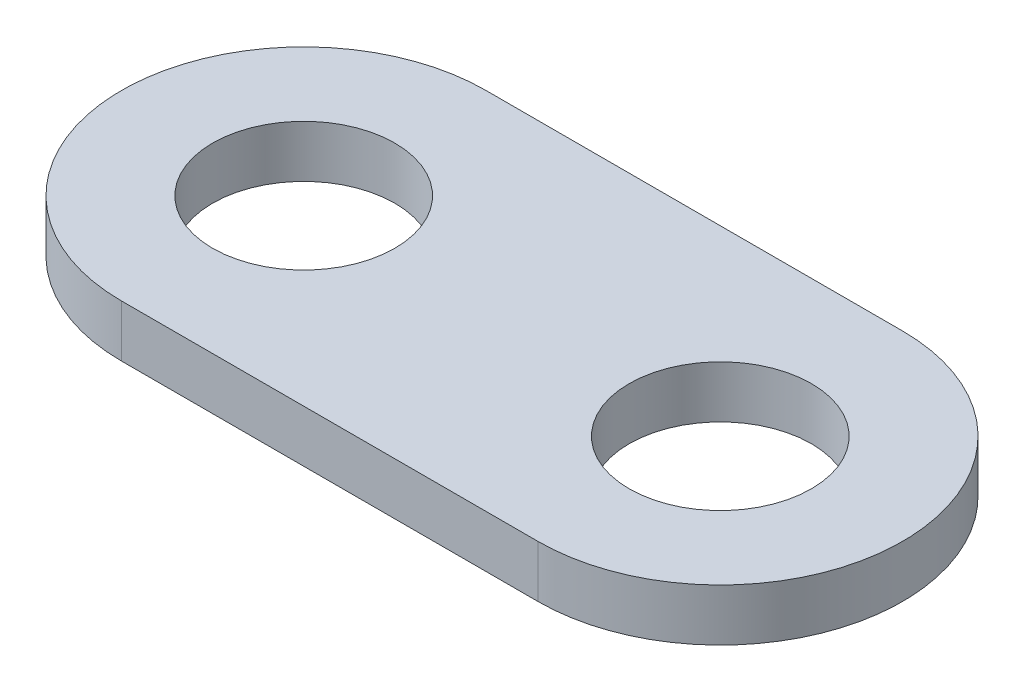
ISO-10303-21;
HEADER;
FILE_DESCRIPTION(('STEP AP214'),'2;1');
FILE_NAME('part.step','',(''),(''),'','','');
FILE_SCHEMA(('AUTOMOTIVE_DESIGN { 1 0 10303 214 1 1 1 1 }'));
ENDSEC;
DATA;
#1=APPLICATION_CONTEXT('core data for automotive mechanical design processes');
#2=APPLICATION_PROTOCOL_DEFINITION('international standard','automotive_design',2000,#1);
#3=PRODUCT_CONTEXT('',#1,'mechanical');
#4=PRODUCT('Part','Part','',(#3));
#5=PRODUCT_RELATED_PRODUCT_CATEGORY('part','',(#4));
#6=PRODUCT_DEFINITION_FORMATION('','',#4);
#7=PRODUCT_DEFINITION_CONTEXT('part definition',#1,'design');
#8=PRODUCT_DEFINITION('design','',#6,#7);
#9=PRODUCT_DEFINITION_SHAPE('','',#8);
#10=(LENGTH_UNIT() NAMED_UNIT(*) SI_UNIT(.MILLI.,.METRE.));
#11=(NAMED_UNIT(*) PLANE_ANGLE_UNIT() SI_UNIT($,.RADIAN.));
#12=(NAMED_UNIT(*) SI_UNIT($,.STERADIAN.) SOLID_ANGLE_UNIT());
#13=UNCERTAINTY_MEASURE_WITH_UNIT(LENGTH_MEASURE(1.E-05),#10,'distance_accuracy_value','');
#14=(GEOMETRIC_REPRESENTATION_CONTEXT(3) GLOBAL_UNCERTAINTY_ASSIGNED_CONTEXT((#13)) GLOBAL_UNIT_ASSIGNED_CONTEXT((#10,
#11,#12)) REPRESENTATION_CONTEXT('',''));
#15=CARTESIAN_POINT('',(0.,0.,0.));
#16=DIRECTION('',(0.,0.,1.));
#17=DIRECTION('',(1.,0.,0.));
#18=AXIS2_PLACEMENT_3D('',#15,#16,#17);
#19=CARTESIAN_POINT('',(-93.1927710843373,10.,4.25551654230957));
#20=DIRECTION('',(0.,1.,0.));
#21=DIRECTION('',(0.,0.,1.));
#22=AXIS2_PLACEMENT_3D('',#19,#20,#21);
#23=PLANE('',#22);
#24=CARTESIAN_POINT('',(-93.1927710843373,10.,4.25551654230957));
#25=DIRECTION('',(0.,1.,0.));
#26=DIRECTION('',(0.,0.,1.));
#27=AXIS2_PLACEMENT_3D('',#24,#25,#26);
#28=CIRCLE('',#27,17.5);
#29=CARTESIAN_POINT('',(-93.1927710843373,10.,21.7555165423096));
#30=VERTEX_POINT('',#29);
#31=EDGE_CURVE('E114',#30,#30,#28,.T.);
#32=ORIENTED_EDGE('',*,*,#31,.F.);
#33=EDGE_LOOP('',(#32));
#34=FACE_BOUND('',#33,.T.);
#35=CARTESIAN_POINT('',(-93.1927710843373,10.,4.25551654230957));
#36=DIRECTION('',(0.,1.,0.));
#37=DIRECTION('',(0.,0.,1.));
#38=AXIS2_PLACEMENT_3D('',#35,#36,#37);
#39=CIRCLE('',#38,35.);
#40=CARTESIAN_POINT('',(-93.1927710843373,10.,-30.7444834576904));
#41=VERTEX_POINT('',#40);
#42=CARTESIAN_POINT('',(-93.1927710843373,10.,39.2555165423096));
#43=VERTEX_POINT('',#42);
#44=EDGE_CURVE('E99',#41,#43,#39,.T.);
#45=ORIENTED_EDGE('',*,*,#44,.T.);
#46=DIRECTION('',(1.,0.,0.));
#47=VECTOR('',#46,1.);
#48=CARTESIAN_POINT('',(-93.1927710843373,10.,39.2555165423096));
#49=LINE('',#48,#47);
#50=CARTESIAN_POINT('',(-13.1927710843373,10.,39.2555165423096));
#51=VERTEX_POINT('',#50);
#52=EDGE_CURVE('E94',#43,#51,#49,.T.);
#53=ORIENTED_EDGE('',*,*,#52,.T.);
#54=CARTESIAN_POINT('',(-13.1927710843373,10.,4.25551654230957));
#55=DIRECTION('',(0.,1.,0.));
#56=DIRECTION('',(0.,0.,-1.));
#57=AXIS2_PLACEMENT_3D('',#54,#55,#56);
#58=CIRCLE('',#57,35.);
#59=CARTESIAN_POINT('',(-13.1927710843373,10.,-30.7444834576904));
#60=VERTEX_POINT('',#59);
#61=EDGE_CURVE('E97',#51,#60,#58,.T.);
#62=ORIENTED_EDGE('',*,*,#61,.T.);
#63=DIRECTION('',(-1.,0.,0.));
#64=VECTOR('',#63,1.);
#65=CARTESIAN_POINT('',(-93.1927710843373,10.,-30.7444834576904));
#66=LINE('',#65,#64);
#67=EDGE_CURVE('E64',#60,#41,#66,.T.);
#68=ORIENTED_EDGE('',*,*,#67,.T.);
#69=EDGE_LOOP('',(#45,#53,#62,#68));
#70=FACE_BOUND('',#69,.T.);
#71=CARTESIAN_POINT('',(-13.1927710843373,10.,4.25551654230957));
#72=DIRECTION('',(0.,1.,0.));
#73=DIRECTION('',(0.,0.,1.));
#74=AXIS2_PLACEMENT_3D('',#71,#72,#73);
#75=CIRCLE('',#74,17.5);
#76=CARTESIAN_POINT('',(-13.1927710843373,10.,21.7555165423096));
#77=VERTEX_POINT('',#76);
#78=EDGE_CURVE('E129',#77,#77,#75,.T.);
#79=ORIENTED_EDGE('',*,*,#78,.F.);
#80=EDGE_LOOP('',(#79));
#81=FACE_BOUND('',#80,.T.);
#82=ADVANCED_FACE('F47',(#34,#70,#81),#23,.T.);
#83=CARTESIAN_POINT('',(-93.1927710843373,0.,4.25551654230957));
#84=DIRECTION('',(0.,1.,0.));
#85=DIRECTION('',(0.,0.,1.));
#86=AXIS2_PLACEMENT_3D('',#83,#84,#85);
#87=PLANE('',#86);
#88=CARTESIAN_POINT('',(-93.1927710843373,0.,4.25551654230957));
#89=DIRECTION('',(0.,1.,0.));
#90=DIRECTION('',(0.,0.,1.));
#91=AXIS2_PLACEMENT_3D('',#88,#89,#90);
#92=CIRCLE('',#91,35.);
#93=CARTESIAN_POINT('',(-93.1927710843373,0.,-30.7444834576904));
#94=VERTEX_POINT('',#93);
#95=CARTESIAN_POINT('',(-93.1927710843373,0.,39.2555165423096));
#96=VERTEX_POINT('',#95);
#97=EDGE_CURVE('E111',#94,#96,#92,.T.);
#98=ORIENTED_EDGE('',*,*,#97,.F.);
#99=DIRECTION('',(-1.,0.,0.));
#100=VECTOR('',#99,1.);
#101=CARTESIAN_POINT('',(-93.1927710843373,0.,-30.7444834576904));
#102=LINE('',#101,#100);
#103=CARTESIAN_POINT('',(-13.1927710843373,0.,-30.7444834576904));
#104=VERTEX_POINT('',#103);
#105=EDGE_CURVE('E87',#104,#94,#102,.T.);
#106=ORIENTED_EDGE('',*,*,#105,.F.);
#107=CARTESIAN_POINT('',(-13.1927710843373,0.,4.25551654230957));
#108=DIRECTION('',(0.,1.,0.));
#109=DIRECTION('',(0.,0.,-1.));
#110=AXIS2_PLACEMENT_3D('',#107,#108,#109);
#111=CIRCLE('',#110,35.);
#112=CARTESIAN_POINT('',(-13.1927710843373,0.,39.2555165423096));
#113=VERTEX_POINT('',#112);
#114=EDGE_CURVE('E81',#113,#104,#111,.T.);
#115=ORIENTED_EDGE('',*,*,#114,.F.);
#116=DIRECTION('',(1.,0.,0.));
#117=VECTOR('',#116,1.);
#118=CARTESIAN_POINT('',(-93.1927710843373,0.,39.2555165423096));
#119=LINE('',#118,#117);
#120=EDGE_CURVE('E103',#96,#113,#119,.T.);
#121=ORIENTED_EDGE('',*,*,#120,.F.);
#122=EDGE_LOOP('',(#98,#106,#115,#121));
#123=FACE_BOUND('',#122,.T.);
#124=CARTESIAN_POINT('',(-93.1927710843373,0.,4.25551654230957));
#125=DIRECTION('',(0.,1.,0.));
#126=DIRECTION('',(0.,0.,1.));
#127=AXIS2_PLACEMENT_3D('',#124,#125,#126);
#128=CIRCLE('',#127,17.5);
#129=CARTESIAN_POINT('',(-93.1927710843373,0.,21.7555165423096));
#130=VERTEX_POINT('',#129);
#131=EDGE_CURVE('E126',#130,#130,#128,.T.);
#132=ORIENTED_EDGE('',*,*,#131,.T.);
#133=EDGE_LOOP('',(#132));
#134=FACE_BOUND('',#133,.T.);
#135=CARTESIAN_POINT('',(-13.1927710843373,0.,4.25551654230957));
#136=DIRECTION('',(0.,1.,0.));
#137=DIRECTION('',(0.,0.,1.));
#138=AXIS2_PLACEMENT_3D('',#135,#136,#137);
#139=CIRCLE('',#138,17.5);
#140=CARTESIAN_POINT('',(-13.1927710843373,0.,21.7555165423096));
#141=VERTEX_POINT('',#140);
#142=EDGE_CURVE('E132',#141,#141,#139,.T.);
#143=ORIENTED_EDGE('',*,*,#142,.T.);
#144=EDGE_LOOP('',(#143));
#145=FACE_BOUND('',#144,.T.);
#146=ADVANCED_FACE('F122',(#123,#134,#145),#87,.F.);
#147=CARTESIAN_POINT('',(-93.1927710843373,10.,4.25551654230957));
#148=DIRECTION('',(0.,-1.,0.));
#149=DIRECTION('',(0.,0.,-1.));
#150=AXIS2_PLACEMENT_3D('',#147,#148,#149);
#151=CYLINDRICAL_SURFACE('',#150,35.);
#152=ORIENTED_EDGE('',*,*,#97,.T.);
#153=DIRECTION('',(0.,-1.,0.));
#154=VECTOR('',#153,1.);
#155=CARTESIAN_POINT('',(-93.1927710843373,10.,39.2555165423096));
#156=LINE('',#155,#154);
#157=EDGE_CURVE('E11',#43,#96,#156,.T.);
#158=ORIENTED_EDGE('',*,*,#157,.F.);
#159=ORIENTED_EDGE('',*,*,#44,.F.);
#160=DIRECTION('',(0.,-1.,0.));
#161=VECTOR('',#160,1.);
#162=CARTESIAN_POINT('',(-93.1927710843373,10.,-30.7444834576904));
#163=LINE('',#162,#161);
#164=EDGE_CURVE('E107',#41,#94,#163,.T.);
#165=ORIENTED_EDGE('',*,*,#164,.T.);
#166=EDGE_LOOP('',(#152,#158,#159,#165));
#167=FACE_BOUND('',#166,.T.);
#168=ADVANCED_FACE('F49',(#167),#151,.T.);
#169=CARTESIAN_POINT('',(-93.1927710843373,10.,39.2555165423096));
#170=DIRECTION('',(0.,0.,-1.));
#171=DIRECTION('',(-1.,0.,0.));
#172=AXIS2_PLACEMENT_3D('',#169,#170,#171);
#173=PLANE('',#172);
#174=ORIENTED_EDGE('',*,*,#120,.T.);
#175=DIRECTION('',(0.,-1.,0.));
#176=VECTOR('',#175,1.);
#177=CARTESIAN_POINT('',(-13.1927710843373,10.,39.2555165423096));
#178=LINE('',#177,#176);
#179=EDGE_CURVE('E56',#51,#113,#178,.T.);
#180=ORIENTED_EDGE('',*,*,#179,.F.);
#181=ORIENTED_EDGE('',*,*,#52,.F.);
#182=ORIENTED_EDGE('',*,*,#157,.T.);
#183=EDGE_LOOP('',(#174,#180,#181,#182));
#184=FACE_BOUND('',#183,.T.);
#185=ADVANCED_FACE('F102',(#184),#173,.F.);
#186=CARTESIAN_POINT('',(-13.1927710843373,10.,4.25551654230957));
#187=DIRECTION('',(0.,-1.,0.));
#188=DIRECTION('',(0.,0.,-1.));
#189=AXIS2_PLACEMENT_3D('',#186,#187,#188);
#190=CYLINDRICAL_SURFACE('',#189,35.);
#191=ORIENTED_EDGE('',*,*,#114,.T.);
#192=DIRECTION('',(0.,-1.,0.));
#193=VECTOR('',#192,1.);
#194=CARTESIAN_POINT('',(-13.1927710843373,10.,-30.7444834576904));
#195=LINE('',#194,#193);
#196=EDGE_CURVE('E104',#60,#104,#195,.T.);
#197=ORIENTED_EDGE('',*,*,#196,.F.);
#198=ORIENTED_EDGE('',*,*,#61,.F.);
#199=ORIENTED_EDGE('',*,*,#179,.T.);
#200=EDGE_LOOP('',(#191,#197,#198,#199));
#201=FACE_BOUND('',#200,.T.);
#202=ADVANCED_FACE('F105',(#201),#190,.T.);
#203=CARTESIAN_POINT('',(-93.1927710843373,10.,-30.7444834576904));
#204=DIRECTION('',(0.,0.,1.));
#205=DIRECTION('',(1.,0.,0.));
#206=AXIS2_PLACEMENT_3D('',#203,#204,#205);
#207=PLANE('',#206);
#208=ORIENTED_EDGE('',*,*,#105,.T.);
#209=ORIENTED_EDGE('',*,*,#164,.F.);
#210=ORIENTED_EDGE('',*,*,#67,.F.);
#211=ORIENTED_EDGE('',*,*,#196,.T.);
#212=EDGE_LOOP('',(#208,#209,#210,#211));
#213=FACE_BOUND('',#212,.T.);
#214=ADVANCED_FACE('F119',(#213),#207,.F.);
#215=CARTESIAN_POINT('',(-93.1927710843373,10.,4.25551654230957));
#216=DIRECTION('',(0.,-1.,0.));
#217=DIRECTION('',(0.,0.,-1.));
#218=AXIS2_PLACEMENT_3D('',#215,#216,#217);
#219=CYLINDRICAL_SURFACE('',#218,17.5);
#220=ORIENTED_EDGE('',*,*,#31,.T.);
#221=EDGE_LOOP('',(#220));
#222=FACE_BOUND('',#221,.T.);
#223=ORIENTED_EDGE('',*,*,#131,.F.);
#224=EDGE_LOOP('',(#223));
#225=FACE_BOUND('',#224,.T.);
#226=ADVANCED_FACE('F149',(#222,#225),#219,.F.);
#227=CARTESIAN_POINT('',(-13.1927710843373,10.,4.25551654230957));
#228=DIRECTION('',(0.,-1.,0.));
#229=DIRECTION('',(0.,0.,-1.));
#230=AXIS2_PLACEMENT_3D('',#227,#228,#229);
#231=CYLINDRICAL_SURFACE('',#230,17.5);
#232=ORIENTED_EDGE('',*,*,#78,.T.);
#233=EDGE_LOOP('',(#232));
#234=FACE_BOUND('',#233,.T.);
#235=ORIENTED_EDGE('',*,*,#142,.F.);
#236=EDGE_LOOP('',(#235));
#237=FACE_BOUND('',#236,.T.);
#238=ADVANCED_FACE('F138',(#234,#237),#231,.F.);
#239=CLOSED_SHELL('',(#82,#146,#168,#185,#202,#214,#226,#238));
#240=MANIFOLD_SOLID_BREP('B2',#239);
#241=ADVANCED_BREP_SHAPE_REPRESENTATION('',(#18,#240),#14);
#242=SHAPE_DEFINITION_REPRESENTATION(#9,#241);
ENDSEC;
END-ISO-10303-21;
